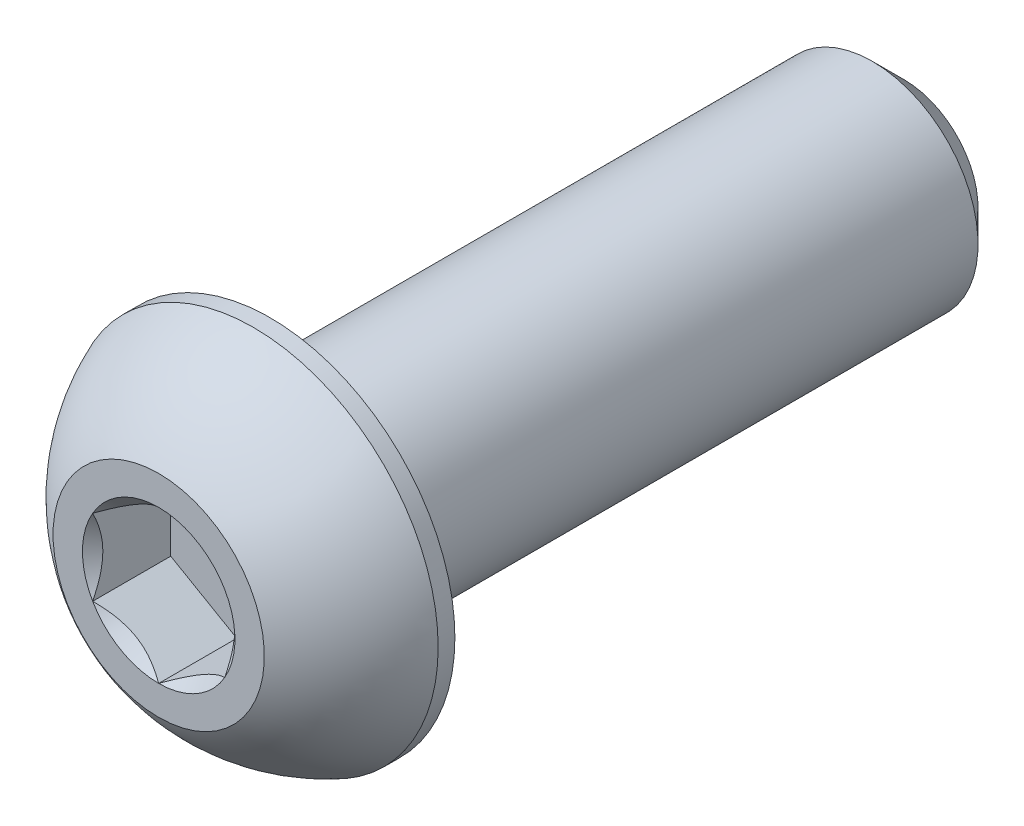
ISO-10303-21;
HEADER;
FILE_DESCRIPTION(('STEP AP214'),'2;1');
FILE_NAME('part.step','',(''),(''),'','','');
FILE_SCHEMA(('AUTOMOTIVE_DESIGN { 1 0 10303 214 1 1 1 1 }'));
ENDSEC;
DATA;
#1=APPLICATION_CONTEXT('core data for automotive mechanical design processes');
#2=APPLICATION_PROTOCOL_DEFINITION('international standard','automotive_design',2000,#1);
#3=PRODUCT_CONTEXT('',#1,'mechanical');
#4=PRODUCT('Part','Part','',(#3));
#5=PRODUCT_RELATED_PRODUCT_CATEGORY('part','',(#4));
#6=PRODUCT_DEFINITION_FORMATION('','',#4);
#7=PRODUCT_DEFINITION_CONTEXT('part definition',#1,'design');
#8=PRODUCT_DEFINITION('design','',#6,#7);
#9=PRODUCT_DEFINITION_SHAPE('','',#8);
#10=(LENGTH_UNIT() NAMED_UNIT(*) SI_UNIT(.MILLI.,.METRE.));
#11=(NAMED_UNIT(*) PLANE_ANGLE_UNIT() SI_UNIT($,.RADIAN.));
#12=(NAMED_UNIT(*) SI_UNIT($,.STERADIAN.) SOLID_ANGLE_UNIT());
#13=UNCERTAINTY_MEASURE_WITH_UNIT(LENGTH_MEASURE(1.E-05),#10,'distance_accuracy_value','');
#14=(GEOMETRIC_REPRESENTATION_CONTEXT(3) GLOBAL_UNCERTAINTY_ASSIGNED_CONTEXT((#13)) GLOBAL_UNIT_ASSIGNED_CONTEXT((#10,
#11,#12)) REPRESENTATION_CONTEXT('',''));
#15=CARTESIAN_POINT('',(0.,0.,0.));
#16=DIRECTION('',(0.,0.,1.));
#17=DIRECTION('',(1.,0.,0.));
#18=AXIS2_PLACEMENT_3D('',#15,#16,#17);
#19=CARTESIAN_POINT('',(0.,-3.17500000000001,-22.4028));
#20=DIRECTION('',(0.,0.,-1.));
#21=DIRECTION('',(0.,1.,0.));
#22=AXIS2_PLACEMENT_3D('',#19,#20,#21);
#23=PLANE('',#22);
#24=CARTESIAN_POINT('',(0.,0.,-22.4028));
#25=DIRECTION('',(0.,0.,-1.));
#26=DIRECTION('',(0.,1.,0.));
#27=AXIS2_PLACEMENT_3D('',#24,#25,#26);
#28=CIRCLE('',#27,2.2225);
#29=CARTESIAN_POINT('',(0.,2.2225,-22.4028));
#30=VERTEX_POINT('',#29);
#31=EDGE_CURVE('E177',#30,#30,#28,.T.);
#32=ORIENTED_EDGE('',*,*,#31,.T.);
#33=EDGE_LOOP('',(#32));
#34=FACE_BOUND('',#33,.T.);
#35=ADVANCED_FACE('F37',(#34),#23,.T.);
#36=CARTESIAN_POINT('',(0.,0.,-22.4028));
#37=DIRECTION('',(0.,0.,-1.));
#38=DIRECTION('',(0.,1.,0.));
#39=AXIS2_PLACEMENT_3D('',#36,#37,#38);
#40=CYLINDRICAL_SURFACE('',#39,3.175);
#41=CARTESIAN_POINT('',(0.,0.,-21.4503));
#42=DIRECTION('',(0.,0.,-1.));
#43=DIRECTION('',(0.,1.,0.));
#44=AXIS2_PLACEMENT_3D('',#41,#42,#43);
#45=CIRCLE('',#44,3.175);
#46=CARTESIAN_POINT('',(0.,3.175,-21.4503));
#47=VERTEX_POINT('',#46);
#48=EDGE_CURVE('E51',#47,#47,#45,.F.);
#49=ORIENTED_EDGE('',*,*,#48,.T.);
#50=EDGE_LOOP('',(#49));
#51=FACE_BOUND('',#50,.T.);
#52=CARTESIAN_POINT('',(0.,0.,-3.3528));
#53=DIRECTION('',(0.,0.,1.));
#54=DIRECTION('',(1.,0.,0.));
#55=AXIS2_PLACEMENT_3D('',#52,#53,#54);
#56=CIRCLE('',#55,3.175);
#57=CARTESIAN_POINT('',(3.175,0.,-3.3528));
#58=VERTEX_POINT('',#57);
#59=EDGE_CURVE('E174',#58,#58,#56,.F.);
#60=ORIENTED_EDGE('',*,*,#59,.T.);
#61=EDGE_LOOP('',(#60));
#62=FACE_BOUND('',#61,.T.);
#63=ADVANCED_FACE('F182',(#51,#62),#40,.T.);
#64=CARTESIAN_POINT('',(0.,0.,-22.4028));
#65=DIRECTION('',(0.,0.,1.));
#66=DIRECTION('',(0.,-1.,0.));
#67=AXIS2_PLACEMENT_3D('',#64,#65,#66);
#68=CONICAL_SURFACE('',#67,2.2225,0.785398163397447);
#69=ORIENTED_EDGE('',*,*,#48,.F.);
#70=EDGE_LOOP('',(#69));
#71=FACE_BOUND('',#70,.T.);
#72=ORIENTED_EDGE('',*,*,#31,.F.);
#73=EDGE_LOOP('',(#72));
#74=FACE_BOUND('',#73,.T.);
#75=ADVANCED_FACE('F39',(#71,#74),#68,.T.);
#76=CARTESIAN_POINT('',(0.,0.,-5.060315));
#77=DIRECTION('',(0.,0.,1.));
#78=DIRECTION('',(0.,-1.,0.));
#79=AXIS2_PLACEMENT_3D('',#76,#77,#78);
#80=SPHERICAL_SURFACE('',#79,5.97389428256184);
#81=CARTESIAN_POINT('',(0.,0.,0.));
#82=DIRECTION('',(0.,0.,1.));
#83=DIRECTION('',(1.,0.,0.));
#84=AXIS2_PLACEMENT_3D('',#81,#82,#83);
#85=CIRCLE('',#84,3.175);
#86=CARTESIAN_POINT('',(0.,-3.175,0.));
#87=VERTEX_POINT('',#86);
#88=EDGE_CURVE('E171',#87,#87,#85,.T.);
#89=CARTESIAN_POINT('',(0.,0.,-2.84988));
#90=DIRECTION('',(0.,0.,1.));
#91=DIRECTION('',(1.,0.,0.));
#92=AXIS2_PLACEMENT_3D('',#89,#90,#91);
#93=CIRCLE('',#92,5.5499);
#94=CARTESIAN_POINT('',(0.,-5.5499,-2.84988));
#95=VERTEX_POINT('',#94);
#96=EDGE_CURVE('E165',#95,#95,#93,.T.);
#97=CARTESIAN_POINT('',(0.,-3.175,0.));
#98=CARTESIAN_POINT('',(0.,-3.20828343957184,-0.0208830076580502));
#99=CARTESIAN_POINT('',(0.,-3.24136078860705,-0.0420944789280503));
#100=CARTESIAN_POINT('',(0.,-3.30709055775141,-0.0851658910984718));
#101=CARTESIAN_POINT('',(0.,-3.33974297786056,-0.107025831998893));
#102=CARTESIAN_POINT('',(0.,-3.40461014130008,-0.151385725836676));
#103=CARTESIAN_POINT('',(0.,-3.43682488463043,-0.173885678774039));
#104=CARTESIAN_POINT('',(0.,-3.50080416139461,-0.219516822259479));
#105=CARTESIAN_POINT('',(0.,-3.53256869482844,-0.242648012807557));
#106=CARTESIAN_POINT('',(0.,-3.59563518208834,-0.289532629449102));
#107=CARTESIAN_POINT('',(0.,-3.62693713591442,-0.313286055542569));
#108=CARTESIAN_POINT('',(0.,-3.68906627753106,-0.36140589409133));
#109=CARTESIAN_POINT('',(0.,-3.71989346532163,-0.385772306546626));
#110=CARTESIAN_POINT('',(0.,-3.78106107243204,-0.435108631276877));
#111=CARTESIAN_POINT('',(0.,-3.8114014917519,-0.460078543551833));
#112=CARTESIAN_POINT('',(0.,-3.87158374923259,-0.510612146063938));
#113=CARTESIAN_POINT('',(0.,-3.90142558739343,-0.536175836301086));
#114=CARTESIAN_POINT('',(0.,-3.96059906392414,-0.587887041792083));
#115=CARTESIAN_POINT('',(0.,-3.989930702294,-0.614034557045931));
#116=CARTESIAN_POINT('',(0.,-4.04807235926832,-0.666903232293407));
#117=CARTESIAN_POINT('',(0.,-4.07688237787279,-0.693624392287034));
#118=CARTESIAN_POINT('',(0.,-4.13396957842491,-0.747629953401057));
#119=CARTESIAN_POINT('',(0.,-4.16224676037257,-0.774914354521453));
#120=CARTESIAN_POINT('',(0.,-4.21825727817542,-0.830035774981947));
#121=CARTESIAN_POINT('',(0.,-4.24599061403061,-0.857872794322045));
#122=CARTESIAN_POINT('',(0.,-4.30090264195357,-0.91408861315902));
#123=CARTESIAN_POINT('',(0.,-4.32808133402134,-0.942467412655899));
#124=CARTESIAN_POINT('',(0.,-4.38187349261953,-0.999755742806741));
#125=CARTESIAN_POINT('',(0.,-4.40848695914995,-1.0286652734607));
#126=CARTESIAN_POINT('',(0.,-4.46113830498838,-1.08700381029123));
#127=CARTESIAN_POINT('',(0.,-4.48717618429639,-1.11643281646778));
#128=CARTESIAN_POINT('',(0.,-4.53866621810402,-1.17579884645643));
#129=CARTESIAN_POINT('',(0.,-4.56411837260364,-1.20573587026853));
#130=CARTESIAN_POINT('',(0.,-4.61442704725457,-1.26610627984964));
#131=CARTESIAN_POINT('',(0.,-4.63928356740587,-1.29653966561866));
#132=CARTESIAN_POINT('',(0.,-4.68839129572448,-1.3578909501815));
#133=CARTESIAN_POINT('',(0.,-4.71264250389178,-1.38880884897531));
#134=CARTESIAN_POINT('',(0.,-4.76053016627881,-1.45111712201534));
#135=CARTESIAN_POINT('',(0.,-4.78416662049853,-1.48250749626155));
#136=CARTESIAN_POINT('',(0.,-4.8308155723751,-1.54574849868041));
#137=CARTESIAN_POINT('',(0.,-4.85382807003194,-1.57759912685306));
#138=CARTESIAN_POINT('',(0.,-4.89922014909859,-1.64174823640362));
#139=CARTESIAN_POINT('',(0.,-4.92159973050841,-1.67404671778154));
#140=CARTESIAN_POINT('',(0.,-4.96571726381658,-1.73907895865427));
#141=CARTESIAN_POINT('',(0.,-4.98745521571493,-1.77181271814908));
#142=CARTESIAN_POINT('',(0.,-5.03028102654719,-1.83770277069632));
#143=CARTESIAN_POINT('',(0.,-5.0513688854811,-1.87085906374874));
#144=CARTESIAN_POINT('',(0.,-5.09288630004063,-1.93758127434189));
#145=CARTESIAN_POINT('',(0.,-5.11331585566624,-1.97114719188261));
#146=CARTESIAN_POINT('',(0.,-5.15350870956168,-2.03867558290299));
#147=CARTESIAN_POINT('',(0.,-5.17327200783151,-2.07263805638265));
#148=CARTESIAN_POINT('',(0.,-5.21212465239608,-2.14094633632486));
#149=CARTESIAN_POINT('',(0.,-5.23121399869082,-2.17529214278741));
#150=CARTESIAN_POINT('',(0.,-5.26871130697935,-2.2443537165359));
#151=CARTESIAN_POINT('',(0.,-5.28711926897315,-2.27906948382184));
#152=CARTESIAN_POINT('',(0.,-5.32324664200827,-2.3488574628552));
#153=CARTESIAN_POINT('',(0.,-5.3409660530496,-2.38392967460262));
#154=CARTESIAN_POINT('',(0.,-5.37570942417474,-2.45441688802313));
#155=CARTESIAN_POINT('',(0.,-5.39273338425856,-2.48983188969622));
#156=CARTESIAN_POINT('',(0.,-5.42607922958184,-2.56099089271574));
#157=CARTESIAN_POINT('',(0.,-5.44240111482132,-2.59673489406217));
#158=CARTESIAN_POINT('',(0.,-5.47433643994316,-2.66853798649801));
#159=CARTESIAN_POINT('',(0.,-5.48994987982553,-2.70459707758742));
#160=CARTESIAN_POINT('',(0.,-5.52046229408188,-2.77701628549785));
#161=CARTESIAN_POINT('',(0.,-5.53536126845586,-2.81337640231887));
#162=CARTESIAN_POINT('',(0.,-5.5499,-2.84988));
#163=B_SPLINE_CURVE_WITH_KNOTS('',3,(#97,#98,#99,#100,#101,#102,#103,#104,#105,#106,#107,#108,
#109,#110,#111,#112,#113,#114,#115,#116,#117,#118,#119,#120,#121,#122,#123,#124,#125,#126,#127,
#128,#129,#130,#131,#132,#133,#134,#135,#136,#137,#138,#139,#140,#141,#142,#143,#144,#145,#146,
#147,#148,#149,#150,#151,#152,#153,#154,#155,#156,#157,#158,#159,#160,#161,#162),.UNSPECIFIED.,
.F.,.F.,(4,2,2,2,2,2,2,2,2,2,2,2,2,2,2,2,2,2,2,2,2,2,2,2,2,2,2,2,2,2,2,2,4),(0.,0.1178750807537,
0.235750161507399,0.353625242261099,0.471500323014798,0.589375403768498,0.707250484522198,
0.825125565275897,0.943000646029597,1.0608757267833,1.17875080753699,1.2966258882907,
1.41450096904439,1.53237604979809,1.65025113055179,1.76812621130549,1.88600129205919,
2.00387637281289,2.12175145356659,2.23962653432029,2.35750161507399,2.47537669582769,
2.59325177658139,2.71112685733509,2.82900193808879,2.94687701884249,3.06475209959619,
3.18262718034989,3.30050226110359,3.41837734185729,3.53625242261099,3.65412750336469,
3.77200258411839),.UNSPECIFIED.);
#164=EDGE_CURVE('BSEAM187',#87,#95,#163,.T.);
#165=ORIENTED_EDGE('',*,*,#88,.F.);
#166=ORIENTED_EDGE('',*,*,#96,.T.);
#167=ORIENTED_EDGE('',*,*,#164,.T.);
#168=ORIENTED_EDGE('',*,*,#164,.F.);
#169=EDGE_LOOP('',(#165,#167,#166,#168));
#170=FACE_BOUND('',#169,.T.);
#171=ADVANCED_FACE('F187',(#170),#80,.T.);
#172=CARTESIAN_POINT('',(0.,-3.175,0.));
#173=DIRECTION('',(0.,0.,-1.));
#174=DIRECTION('',(-1.,0.,0.));
#175=AXIS2_PLACEMENT_3D('',#172,#173,#174);
#176=PLANE('',#175);
#177=CARTESIAN_POINT('',(0.,0.,0.));
#178=DIRECTION('',(0.,0.,1.));
#179=DIRECTION('',(1.,0.,0.));
#180=AXIS2_PLACEMENT_3D('',#177,#178,#179);
#181=CIRCLE('',#180,2.29135888084633);
#182=CARTESIAN_POINT('',(-1.984375,1.14567944042316,0.));
#183=VERTEX_POINT('',#182);
#184=CARTESIAN_POINT('',(-1.984375,-1.14567944042316,0.));
#185=VERTEX_POINT('',#184);
#186=EDGE_CURVE('E64',#183,#185,#181,.T.);
#187=ORIENTED_EDGE('',*,*,#186,.F.);
#188=CARTESIAN_POINT('',(0.,2.29135888084633,0.));
#189=VERTEX_POINT('',#188);
#190=EDGE_CURVE('E136',#189,#183,#181,.T.);
#191=ORIENTED_EDGE('',*,*,#190,.F.);
#192=CARTESIAN_POINT('',(1.984375,1.14567944042316,0.));
#193=VERTEX_POINT('',#192);
#194=EDGE_CURVE('E133',#193,#189,#181,.T.);
#195=ORIENTED_EDGE('',*,*,#194,.F.);
#196=CARTESIAN_POINT('',(1.984375,-1.14567944042316,0.));
#197=VERTEX_POINT('',#196);
#198=EDGE_CURVE('E104',#197,#193,#181,.T.);
#199=ORIENTED_EDGE('',*,*,#198,.F.);
#200=CARTESIAN_POINT('',(0.,-2.29135888084633,0.));
#201=VERTEX_POINT('',#200);
#202=EDGE_CURVE('E96',#201,#197,#181,.T.);
#203=ORIENTED_EDGE('',*,*,#202,.F.);
#204=EDGE_CURVE('E57',#185,#201,#181,.T.);
#205=ORIENTED_EDGE('',*,*,#204,.F.);
#206=EDGE_LOOP('',(#187,#191,#195,#199,#203,#205));
#207=FACE_BOUND('',#206,.T.);
#208=ORIENTED_EDGE('',*,*,#88,.T.);
#209=EDGE_LOOP('',(#208));
#210=FACE_BOUND('',#209,.T.);
#211=ADVANCED_FACE('F130',(#207,#210),#176,.F.);
#212=CARTESIAN_POINT('',(0.,-5.5499,-3.3528));
#213=DIRECTION('',(0.,0.,1.));
#214=DIRECTION('',(1.,0.,0.));
#215=AXIS2_PLACEMENT_3D('',#212,#213,#214);
#216=PLANE('',#215);
#217=ORIENTED_EDGE('',*,*,#59,.F.);
#218=EDGE_LOOP('',(#217));
#219=FACE_BOUND('',#218,.T.);
#220=CARTESIAN_POINT('',(0.,0.,-3.3528));
#221=DIRECTION('',(0.,0.,1.));
#222=DIRECTION('',(1.,0.,0.));
#223=AXIS2_PLACEMENT_3D('',#220,#221,#222);
#224=CIRCLE('',#223,5.5499);
#225=CARTESIAN_POINT('',(5.5499,0.,-3.3528));
#226=VERTEX_POINT('',#225);
#227=EDGE_CURVE('E168',#226,#226,#224,.T.);
#228=ORIENTED_EDGE('',*,*,#227,.F.);
#229=EDGE_LOOP('',(#228));
#230=FACE_BOUND('',#229,.T.);
#231=ADVANCED_FACE('F201',(#219,#230),#216,.F.);
#232=CARTESIAN_POINT('',(0.,0.,0.));
#233=DIRECTION('',(0.,0.,1.));
#234=DIRECTION('',(1.,0.,0.));
#235=AXIS2_PLACEMENT_3D('',#232,#233,#234);
#236=CYLINDRICAL_SURFACE('',#235,5.5499);
#237=ORIENTED_EDGE('',*,*,#96,.F.);
#238=EDGE_LOOP('',(#237));
#239=FACE_BOUND('',#238,.T.);
#240=ORIENTED_EDGE('',*,*,#227,.T.);
#241=EDGE_LOOP('',(#240));
#242=FACE_BOUND('',#241,.T.);
#243=ADVANCED_FACE('F204',(#239,#242),#236,.T.);
#244=CARTESIAN_POINT('',(0.,0.,0.));
#245=DIRECTION('',(0.,0.,1.));
#246=DIRECTION('',(1.,0.,0.));
#247=AXIS2_PLACEMENT_3D('',#244,#245,#246);
#248=CONICAL_SURFACE('',#247,2.29135888084633,0.78539816339745);
#249=ORIENTED_EDGE('',*,*,#198,.T.);
#250=CARTESIAN_POINT('',(1.984375,-2.28495242157822,0.734984078816568));
#251=CARTESIAN_POINT('',(1.984375,-2.22931635455402,0.692986685550762));
#252=CARTESIAN_POINT('',(1.984375,-2.17336876548389,0.651396054076336));
#253=CARTESIAN_POINT('',(1.984375,-2.06072770258171,0.569208461471479));
#254=CARTESIAN_POINT('',(1.984375,-2.00403404503435,0.528611752405042));
#255=CARTESIAN_POINT('',(1.984375,-1.88936329173488,0.448303503174668));
#256=CARTESIAN_POINT('',(1.984375,-1.83137965519348,0.408601258813307));
#257=CARTESIAN_POINT('',(1.984375,-1.7144280213784,0.330685173401292));
#258=CARTESIAN_POINT('',(1.984375,-1.65546009407228,0.292471227194368));
#259=CARTESIAN_POINT('',(1.984375,-1.47005472306035,0.176252834013637));
#260=CARTESIAN_POINT('',(1.984375,-1.34163909427883,0.101347886872381));
#261=CARTESIAN_POINT('',(1.984375,-1.0784038470548,-0.0356697845602627));
#262=CARTESIAN_POINT('',(1.984375,-0.943607781407424,-0.0978256335176254));
#263=CARTESIAN_POINT('',(1.984375,-0.741275100444881,-0.173867421311381));
#264=CARTESIAN_POINT('',(1.984375,-0.676735408881095,-0.195691938673995));
#265=CARTESIAN_POINT('',(1.984375,-0.546098118112761,-0.234159536462205));
#266=CARTESIAN_POINT('',(1.984375,-0.480000411919955,-0.250802259934452));
#267=CARTESIAN_POINT('',(1.984375,-0.347746170028531,-0.277764619130277));
#268=CARTESIAN_POINT('',(1.984375,-0.281612071479122,-0.288192590264109));
#269=CARTESIAN_POINT('',(1.984375,-0.14863662005235,-0.302521852623404));
#270=CARTESIAN_POINT('',(1.984375,-0.0817953907393235,-0.306424265772614));
#271=CARTESIAN_POINT('',(1.984375,0.0495156750890644,-0.307412948667327));
#272=CARTESIAN_POINT('',(1.984375,0.113983775102991,-0.304740821124985));
#273=CARTESIAN_POINT('',(1.984375,0.242367515846177,-0.293260789502485));
#274=CARTESIAN_POINT('',(1.984375,0.30628310229592,-0.284452289360786));
#275=CARTESIAN_POINT('',(1.984375,0.434181040262184,-0.261030978667103));
#276=CARTESIAN_POINT('',(1.984375,0.498145026858309,-0.246319393767914));
#277=CARTESIAN_POINT('',(1.984375,0.624675616953007,-0.211873818587874));
#278=CARTESIAN_POINT('',(1.984375,0.687242336899689,-0.192140248550805));
#279=CARTESIAN_POINT('',(1.984375,0.884225483826088,-0.12258776276924));
#280=CARTESIAN_POINT('',(1.984375,1.01583674256468,-0.0648475887435034));
#281=CARTESIAN_POINT('',(1.984375,1.27288659242652,0.063530336588798));
#282=CARTESIAN_POINT('',(1.984375,1.3983008827048,0.134214424919413));
#283=CARTESIAN_POINT('',(1.984375,1.57956687990221,0.244516663813199));
#284=CARTESIAN_POINT('',(1.984375,1.63738271299424,0.280969829475364));
#285=CARTESIAN_POINT('',(1.984375,1.75202215386202,0.355415963291705));
#286=CARTESIAN_POINT('',(1.984375,1.80884568601362,0.393409048078054));
#287=CARTESIAN_POINT('',(1.984375,1.92116923084255,0.470338808893091));
#288=CARTESIAN_POINT('',(1.984375,1.97667624512253,0.509265313038791));
#289=CARTESIAN_POINT('',(1.984375,2.08693170717166,0.588147746121386));
#290=CARTESIAN_POINT('',(1.984375,2.14168035934793,0.62810338902403));
#291=CARTESIAN_POINT('',(1.984375,2.19611149046622,0.668480611285427));
#292=B_SPLINE_CURVE_WITH_KNOTS('',3,(#250,#251,#252,#253,#254,#255,#256,#257,#258,#259,#260,
#261,#262,#263,#264,#265,#266,#267,#268,#269,#270,#271,#272,#273,#274,#275,#276,#277,#278,#279,
#280,#281,#282,#283,#284,#285,#286,#287,#288,#289,#290,#291),.UNSPECIFIED.,.F.,.F.,(4,2,2,2,2,2,
2,2,2,2,2,2,2,2,2,2,2,2,2,2,4),(0.,0.209126070008322,0.418304637356569,0.629103979977992,
0.839888401371185,1.28549951116127,1.72957750768351,1.93379389749971,2.13802435186698,
2.33858179514334,2.53910475350639,2.73236963400794,2.92565329006887,3.12231577097487,
3.31896180041345,3.74886295245172,4.18033428125362,4.3853601718029,4.59040161996383,
4.79377749165108,4.99709743524131),.UNSPECIFIED.);
#293=EDGE_CURVE('E11',#197,#193,#292,.T.);
#294=ORIENTED_EDGE('',*,*,#293,.F.);
#295=EDGE_LOOP('',(#249,#294));
#296=FACE_BOUND('',#295,.T.);
#297=ADVANCED_FACE('F108',(#296),#248,.F.);
#298=ORIENTED_EDGE('',*,*,#194,.T.);
#299=CARTESIAN_POINT('',(1.984575,1.14556397036933,0.000115478781843379));
#300=CARTESIAN_POINT('',(1.9163590048332,1.18494849354192,-0.0392371477360855));
#301=CARTESIAN_POINT('',(1.84700231489303,1.22499159714897,-0.0762786895538155));
#302=CARTESIAN_POINT('',(1.70557619954781,1.30664400291398,-0.144101141576677));
#303=CARTESIAN_POINT('',(1.63349332126322,1.34826107209555,-0.174844310908246));
#304=CARTESIAN_POINT('',(1.488141602734,1.43217992591557,-0.227508111188786));
#305=CARTESIAN_POINT('',(1.41490978751306,1.47446033414663,-0.249561124120036));
#306=CARTESIAN_POINT('',(1.26683381740529,1.55995203534886,-0.283538507056124));
#307=CARTESIAN_POINT('',(1.19199418724658,1.60316071596705,-0.295488243908271));
#308=CARTESIAN_POINT('',(1.06301458545618,1.6776271237807,-0.306269900918094));
#309=CARTESIAN_POINT('',(1.00904128422756,1.7087886237741,-0.30786610094093));
#310=CARTESIAN_POINT('',(0.901182881480199,1.77106070163465,-0.305178161134708));
#311=CARTESIAN_POINT('',(0.847297817514476,1.80217125782056,-0.300891959659541));
#312=CARTESIAN_POINT('',(0.740036461751395,1.86409863044402,-0.286683126986481));
#313=CARTESIAN_POINT('',(0.686660807239859,1.89491507894443,-0.276754189547727));
#314=CARTESIAN_POINT('',(0.580832482591103,1.95601509066828,-0.251804915725461));
#315=CARTESIAN_POINT('',(0.528379742028898,1.9862986945516,-0.236784969610512));
#316=CARTESIAN_POINT('',(0.394017661036351,2.06387267818152,-0.19219214836433));
#317=CARTESIAN_POINT('',(0.312941642841675,2.11068193911104,-0.159257004061667));
#318=CARTESIAN_POINT('',(0.19372669327016,2.17951072233758,-0.103657558797803));
#319=CARTESIAN_POINT('',(0.154440075613998,2.20219286161692,-0.0841224079481375));
#320=CARTESIAN_POINT('',(0.0765946381319467,2.24713694590237,-0.0432712618805984));
#321=CARTESIAN_POINT('',(0.0380353888983008,2.26939913882716,-0.0219563604316496));
#322=CARTESIAN_POINT('',(-0.00020000000000058,2.29147435090017,0.000115478781842942));
#323=B_SPLINE_CURVE_WITH_KNOTS('',3,(#299,#300,#301,#302,#303,#304,#305,#306,#307,#308,#309,
#310,#311,#312,#313,#314,#315,#316,#317,#318,#319,#320,#321,#322),.UNSPECIFIED.,.F.,.F.,(4,2,2,
2,2,2,2,2,2,2,2,4),(0.,0.264339630306627,0.530219665093694,0.79187641637146,1.05287424418109,
1.239639843932,1.42647091743852,1.61351120244035,1.8005371524754,2.09764209964316,
2.24579179873714,2.39385111134157),.UNSPECIFIED.);
#324=EDGE_CURVE('E135',#193,#189,#323,.T.);
#325=ORIENTED_EDGE('',*,*,#324,.F.);
#326=EDGE_LOOP('',(#298,#325));
#327=FACE_BOUND('',#326,.T.);
#328=ADVANCED_FACE('F289',(#327),#248,.F.);
#329=ORIENTED_EDGE('',*,*,#190,.T.);
#330=CARTESIAN_POINT('',(0.000199999999999608,2.29147435090017,0.000115478781843248));
#331=CARTESIAN_POINT('',(-0.0680159951668025,2.25208982772757,-0.0392371477360854));
#332=CARTESIAN_POINT('',(-0.137372685106966,2.21204672412052,-0.0762786895538155));
#333=CARTESIAN_POINT('',(-0.278798800452188,2.13039431835551,-0.144101141576677));
#334=CARTESIAN_POINT('',(-0.350881678736783,2.08877724917394,-0.174844310908246));
#335=CARTESIAN_POINT('',(-0.496233397266004,2.00485839535392,-0.227508111188786));
#336=CARTESIAN_POINT('',(-0.569465212486939,1.96257798712287,-0.249561124120036));
#337=CARTESIAN_POINT('',(-0.717541182594707,1.87708628592063,-0.283538507056124));
#338=CARTESIAN_POINT('',(-0.792380812753425,1.83387760530244,-0.295488243908272));
#339=CARTESIAN_POINT('',(-0.921360414543816,1.75941119748879,-0.306269900918094));
#340=CARTESIAN_POINT('',(-0.975333715772443,1.72824969749539,-0.307866100940931));
#341=CARTESIAN_POINT('',(-1.0831921185198,1.66597761963484,-0.305178161134708));
#342=CARTESIAN_POINT('',(-1.13707718248552,1.63486706344893,-0.300891959659541));
#343=CARTESIAN_POINT('',(-1.2443385382486,1.57293969082547,-0.286683126986481));
#344=CARTESIAN_POINT('',(-1.29771419276014,1.54212324232506,-0.276754189547727));
#345=CARTESIAN_POINT('',(-1.4035425174089,1.48102323060122,-0.251804915725462));
#346=CARTESIAN_POINT('',(-1.4559952579711,1.45073962671789,-0.236784969610512));
#347=CARTESIAN_POINT('',(-1.59035733896365,1.37316564308797,-0.19219214836433));
#348=CARTESIAN_POINT('',(-1.67143335715832,1.32635638215845,-0.159257004061668));
#349=CARTESIAN_POINT('',(-1.79064830672984,1.25752759893191,-0.103657558797804));
#350=CARTESIAN_POINT('',(-1.829934924386,1.23484545965257,-0.0841224079481378));
#351=CARTESIAN_POINT('',(-1.90778036186805,1.18990137536712,-0.0432712618805986));
#352=CARTESIAN_POINT('',(-1.9463396111017,1.16763918244233,-0.0219563604316498));
#353=CARTESIAN_POINT('',(-1.984575,1.14556397036933,0.000115478781842511));
#354=B_SPLINE_CURVE_WITH_KNOTS('',3,(#330,#331,#332,#333,#334,#335,#336,#337,#338,#339,#340,
#341,#342,#343,#344,#345,#346,#347,#348,#349,#350,#351,#352,#353),.UNSPECIFIED.,.F.,.F.,(4,2,2,
2,2,2,2,2,2,2,2,4),(0.,0.264339630306627,0.530219665093694,0.791876416371461,1.05287424418109,
1.239639843932,1.42647091743852,1.61351120244035,1.8005371524754,2.09764209964316,
2.24579179873714,2.39385111134157),.UNSPECIFIED.);
#355=EDGE_CURVE('E140',#189,#183,#354,.T.);
#356=ORIENTED_EDGE('',*,*,#355,.F.);
#357=EDGE_LOOP('',(#329,#356));
#358=FACE_BOUND('',#357,.T.);
#359=ADVANCED_FACE('F143',(#358),#248,.F.);
#360=ORIENTED_EDGE('',*,*,#186,.T.);
#361=CARTESIAN_POINT('',(-1.984375,-2.28495242157823,0.734984078816569));
#362=CARTESIAN_POINT('',(-1.984375,-2.22931635455402,0.692986685550762));
#363=CARTESIAN_POINT('',(-1.984375,-2.17336876548389,0.651396054076336));
#364=CARTESIAN_POINT('',(-1.984375,-2.06072770258171,0.56920846147148));
#365=CARTESIAN_POINT('',(-1.984375,-2.00403404503435,0.528611752405043));
#366=CARTESIAN_POINT('',(-1.984375,-1.88936329173489,0.448303503174669));
#367=CARTESIAN_POINT('',(-1.984375,-1.83137965519348,0.408601258813308));
#368=CARTESIAN_POINT('',(-1.984375,-1.7144280213784,0.330685173401292));
#369=CARTESIAN_POINT('',(-1.984375,-1.65546009407228,0.292471227194368));
#370=CARTESIAN_POINT('',(-1.984375,-1.47005472306035,0.176252834013636));
#371=CARTESIAN_POINT('',(-1.984375,-1.34163909427883,0.101347886872382));
#372=CARTESIAN_POINT('',(-1.984375,-1.0784038470548,-0.0356697845602624));
#373=CARTESIAN_POINT('',(-1.984375,-0.943607781407425,-0.0978256335176256));
#374=CARTESIAN_POINT('',(-1.984375,-0.741275100444882,-0.173867421311381));
#375=CARTESIAN_POINT('',(-1.984375,-0.676735408881095,-0.195691938673995));
#376=CARTESIAN_POINT('',(-1.984375,-0.546098118112762,-0.234159536462205));
#377=CARTESIAN_POINT('',(-1.984375,-0.480000411919956,-0.250802259934452));
#378=CARTESIAN_POINT('',(-1.984375,-0.347746170028532,-0.277764619130277));
#379=CARTESIAN_POINT('',(-1.984375,-0.281612071479123,-0.288192590264108));
#380=CARTESIAN_POINT('',(-1.984375,-0.14863662005235,-0.302521852623404));
#381=CARTESIAN_POINT('',(-1.984375,-0.0817953907393237,-0.306424265772614));
#382=CARTESIAN_POINT('',(-1.984375,0.0495156750890643,-0.307412948667328));
#383=CARTESIAN_POINT('',(-1.984375,0.113983775102991,-0.304740821124985));
#384=CARTESIAN_POINT('',(-1.984375,0.242367515846177,-0.293260789502485));
#385=CARTESIAN_POINT('',(-1.984375,0.306283102295919,-0.284452289360786));
#386=CARTESIAN_POINT('',(-1.984375,0.434181040262184,-0.261030978667103));
#387=CARTESIAN_POINT('',(-1.984375,0.498145026858309,-0.246319393767914));
#388=CARTESIAN_POINT('',(-1.984375,0.624675616953007,-0.211873818587874));
#389=CARTESIAN_POINT('',(-1.984375,0.687242336899689,-0.192140248550805));
#390=CARTESIAN_POINT('',(-1.984375,0.884225483826087,-0.12258776276924));
#391=CARTESIAN_POINT('',(-1.984375,1.01583674256468,-0.0648475887435036));
#392=CARTESIAN_POINT('',(-1.984375,1.27288659242652,0.0635303365887976));
#393=CARTESIAN_POINT('',(-1.984375,1.3983008827048,0.134214424919412));
#394=CARTESIAN_POINT('',(-1.984375,1.57956687990221,0.244516663813198));
#395=CARTESIAN_POINT('',(-1.984375,1.63738271299424,0.280969829475363));
#396=CARTESIAN_POINT('',(-1.984375,1.75202215386202,0.355415963291704));
#397=CARTESIAN_POINT('',(-1.984375,1.80884568601362,0.393409048078054));
#398=CARTESIAN_POINT('',(-1.984375,1.92116923084255,0.47033880889309));
#399=CARTESIAN_POINT('',(-1.984375,1.97667624512253,0.509265313038791));
#400=CARTESIAN_POINT('',(-1.984375,2.08693170717166,0.588147746121386));
#401=CARTESIAN_POINT('',(-1.984375,2.14168035934793,0.628103389024029));
#402=CARTESIAN_POINT('',(-1.984375,2.19611149046622,0.668480611285426));
#403=B_SPLINE_CURVE_WITH_KNOTS('',3,(#361,#362,#363,#364,#365,#366,#367,#368,#369,#370,#371,
#372,#373,#374,#375,#376,#377,#378,#379,#380,#381,#382,#383,#384,#385,#386,#387,#388,#389,#390,
#391,#392,#393,#394,#395,#396,#397,#398,#399,#400,#401,#402),.UNSPECIFIED.,.F.,.F.,(4,2,2,2,2,2,
2,2,2,2,2,2,2,2,2,2,2,2,2,2,4),(0.,0.209126070008322,0.41830463735657,0.629103979977993,
0.839888401371186,1.28549951116127,1.72957750768351,1.93379389749972,2.13802435186698,
2.33858179514334,2.53910475350639,2.73236963400794,2.92565329006887,3.12231577097488,
3.31896180041345,3.74886295245172,4.18033428125362,4.3853601718029,4.59040161996383,
4.79377749165108,4.99709743524131),.UNSPECIFIED.);
#404=EDGE_CURVE('E147',#183,#185,#403,.F.);
#405=ORIENTED_EDGE('',*,*,#404,.F.);
#406=EDGE_LOOP('',(#360,#405));
#407=FACE_BOUND('',#406,.T.);
#408=ADVANCED_FACE('F283',(#407),#248,.F.);
#409=ORIENTED_EDGE('',*,*,#204,.T.);
#410=CARTESIAN_POINT('',(-1.984575,-1.14556397036933,0.000115478781843379));
#411=CARTESIAN_POINT('',(-1.9163590048332,-1.18494849354192,-0.0392371477360847));
#412=CARTESIAN_POINT('',(-1.84700231489303,-1.22499159714897,-0.0762786895538149));
#413=CARTESIAN_POINT('',(-1.70557619954781,-1.30664400291398,-0.144101141576677));
#414=CARTESIAN_POINT('',(-1.63349332126322,-1.34826107209555,-0.174844310908247));
#415=CARTESIAN_POINT('',(-1.488141602734,-1.43217992591557,-0.227508111188786));
#416=CARTESIAN_POINT('',(-1.41490978751306,-1.47446033414663,-0.249561124120036));
#417=CARTESIAN_POINT('',(-1.26683381740529,-1.55995203534886,-0.283538507056124));
#418=CARTESIAN_POINT('',(-1.19199418724658,-1.60316071596705,-0.295488243908271));
#419=CARTESIAN_POINT('',(-1.06301458545618,-1.6776271237807,-0.306269900918094));
#420=CARTESIAN_POINT('',(-1.00904128422756,-1.7087886237741,-0.30786610094093));
#421=CARTESIAN_POINT('',(-0.9011828814802,-1.77106070163465,-0.305178161134707));
#422=CARTESIAN_POINT('',(-0.847297817514477,-1.80217125782056,-0.30089195965954));
#423=CARTESIAN_POINT('',(-0.740036461751396,-1.86409863044402,-0.286683126986481));
#424=CARTESIAN_POINT('',(-0.68666080723986,-1.89491507894443,-0.276754189547727));
#425=CARTESIAN_POINT('',(-0.580832482591103,-1.95601509066828,-0.251804915725461));
#426=CARTESIAN_POINT('',(-0.528379742028898,-1.9862986945516,-0.236784969610511));
#427=CARTESIAN_POINT('',(-0.394017661036351,-2.06387267818152,-0.19219214836433));
#428=CARTESIAN_POINT('',(-0.312941642841675,-2.11068193911104,-0.159257004061667));
#429=CARTESIAN_POINT('',(-0.19372669327016,-2.17951072233758,-0.103657558797803));
#430=CARTESIAN_POINT('',(-0.154440075613998,-2.20219286161692,-0.0841224079481371));
#431=CARTESIAN_POINT('',(-0.0765946381319465,-2.24713694590237,-0.0432712618805977));
#432=CARTESIAN_POINT('',(-0.0380353888983009,-2.26939913882716,-0.0219563604316487));
#433=CARTESIAN_POINT('',(0.000200000000000425,-2.29147435090017,0.000115478781843735));
#434=B_SPLINE_CURVE_WITH_KNOTS('',3,(#410,#411,#412,#413,#414,#415,#416,#417,#418,#419,#420,
#421,#422,#423,#424,#425,#426,#427,#428,#429,#430,#431,#432,#433),.UNSPECIFIED.,.F.,.F.,(4,2,2,
2,2,2,2,2,2,2,2,4),(0.,0.264339630306627,0.530219665093694,0.79187641637146,1.05287424418109,
1.239639843932,1.42647091743852,1.61351120244035,1.8005371524754,2.09764209964316,
2.24579179873714,2.39385111134157),.UNSPECIFIED.);
#435=EDGE_CURVE('E120',#185,#201,#434,.T.);
#436=ORIENTED_EDGE('',*,*,#435,.F.);
#437=EDGE_LOOP('',(#409,#436));
#438=FACE_BOUND('',#437,.T.);
#439=ADVANCED_FACE('F231',(#438),#248,.F.);
#440=ORIENTED_EDGE('',*,*,#202,.T.);
#441=CARTESIAN_POINT('',(-0.000199999999999594,-2.29147435090017,0.000115478781843681));
#442=CARTESIAN_POINT('',(0.0680159951668032,-2.25208982772757,-0.0392371477360843));
#443=CARTESIAN_POINT('',(0.137372685106967,-2.21204672412052,-0.0762786895538144));
#444=CARTESIAN_POINT('',(0.278798800452188,-2.13039431835551,-0.144101141576676));
#445=CARTESIAN_POINT('',(0.350881678736783,-2.08877724917394,-0.174844310908246));
#446=CARTESIAN_POINT('',(0.496233397266004,-2.00485839535392,-0.227508111188787));
#447=CARTESIAN_POINT('',(0.569465212486939,-1.96257798712287,-0.249561124120036));
#448=CARTESIAN_POINT('',(0.717541182594707,-1.87708628592063,-0.283538507056124));
#449=CARTESIAN_POINT('',(0.792380812753425,-1.83387760530244,-0.295488243908272));
#450=CARTESIAN_POINT('',(0.921360414543816,-1.75941119748879,-0.306269900918094));
#451=CARTESIAN_POINT('',(0.975333715772443,-1.72824969749539,-0.30786610094093));
#452=CARTESIAN_POINT('',(1.0831921185198,-1.66597761963484,-0.305178161134708));
#453=CARTESIAN_POINT('',(1.13707718248552,-1.63486706344893,-0.300891959659541));
#454=CARTESIAN_POINT('',(1.2443385382486,-1.57293969082547,-0.286683126986481));
#455=CARTESIAN_POINT('',(1.29771419276014,-1.54212324232506,-0.276754189547727));
#456=CARTESIAN_POINT('',(1.4035425174089,-1.48102323060122,-0.251804915725462));
#457=CARTESIAN_POINT('',(1.4559952579711,-1.45073962671789,-0.236784969610512));
#458=CARTESIAN_POINT('',(1.59035733896365,-1.37316564308797,-0.19219214836433));
#459=CARTESIAN_POINT('',(1.67143335715832,-1.32635638215845,-0.159257004061668));
#460=CARTESIAN_POINT('',(1.79064830672984,-1.25752759893191,-0.103657558797804));
#461=CARTESIAN_POINT('',(1.829934924386,-1.23484545965257,-0.0841224079481379));
#462=CARTESIAN_POINT('',(1.90778036186805,-1.18990137536712,-0.0432712618805987));
#463=CARTESIAN_POINT('',(1.9463396111017,-1.16763918244233,-0.0219563604316498));
#464=CARTESIAN_POINT('',(1.984575,-1.14556397036933,0.000115478781842673));
#465=B_SPLINE_CURVE_WITH_KNOTS('',3,(#441,#442,#443,#444,#445,#446,#447,#448,#449,#450,#451,
#452,#453,#454,#455,#456,#457,#458,#459,#460,#461,#462,#463,#464),.UNSPECIFIED.,.F.,.F.,(4,2,2,
2,2,2,2,2,2,2,2,4),(0.,0.264339630306627,0.530219665093695,0.791876416371461,1.05287424418109,
1.239639843932,1.42647091743852,1.61351120244035,1.8005371524754,2.09764209964316,
2.24579179873714,2.39385111134157),.UNSPECIFIED.);
#466=EDGE_CURVE('E100',#201,#197,#465,.T.);
#467=ORIENTED_EDGE('',*,*,#466,.F.);
#468=EDGE_LOOP('',(#440,#467));
#469=FACE_BOUND('',#468,.T.);
#470=ADVANCED_FACE('F98',(#469),#248,.F.);
#471=CARTESIAN_POINT('',(1.984375,-1.14567944042316,-2.34696));
#472=DIRECTION('',(0.,0.,1.));
#473=DIRECTION('',(1.,0.,0.));
#474=AXIS2_PLACEMENT_3D('',#471,#472,#473);
#475=PLANE('',#474);
#476=DIRECTION('',(0.866025403784438,0.5,0.));
#477=VECTOR('',#476,1.);
#478=CARTESIAN_POINT('',(0.,-2.29135888084633,-2.34696));
#479=LINE('',#478,#477);
#480=CARTESIAN_POINT('',(0.,-2.29135888084633,-2.34696));
#481=VERTEX_POINT('',#480);
#482=CARTESIAN_POINT('',(1.984375,-1.14567944042316,-2.34696));
#483=VERTEX_POINT('',#482);
#484=EDGE_CURVE('E119',#481,#483,#479,.T.);
#485=ORIENTED_EDGE('',*,*,#484,.T.);
#486=DIRECTION('',(0.,1.,0.));
#487=VECTOR('',#486,1.);
#488=CARTESIAN_POINT('',(1.984375,-1.14567944042316,-2.34696));
#489=LINE('',#488,#487);
#490=CARTESIAN_POINT('',(1.984375,1.14567944042316,-2.34696));
#491=VERTEX_POINT('',#490);
#492=EDGE_CURVE('E124',#483,#491,#489,.T.);
#493=ORIENTED_EDGE('',*,*,#492,.T.);
#494=DIRECTION('',(-0.866025403784439,0.5,0.));
#495=VECTOR('',#494,1.);
#496=CARTESIAN_POINT('',(1.984375,1.14567944042316,-2.34696));
#497=LINE('',#496,#495);
#498=CARTESIAN_POINT('',(0.,2.29135888084633,-2.34696));
#499=VERTEX_POINT('',#498);
#500=EDGE_CURVE('E273',#491,#499,#497,.T.);
#501=ORIENTED_EDGE('',*,*,#500,.T.);
#502=DIRECTION('',(-0.866025403784438,-0.5,0.));
#503=VECTOR('',#502,1.);
#504=CARTESIAN_POINT('',(0.,2.29135888084633,-2.34696));
#505=LINE('',#504,#503);
#506=CARTESIAN_POINT('',(-1.984375,1.14567944042316,-2.34696));
#507=VERTEX_POINT('',#506);
#508=EDGE_CURVE('E156',#499,#507,#505,.T.);
#509=ORIENTED_EDGE('',*,*,#508,.T.);
#510=DIRECTION('',(0.,-1.,0.));
#511=VECTOR('',#510,1.);
#512=CARTESIAN_POINT('',(-1.984375,1.14567944042316,-2.34696));
#513=LINE('',#512,#511);
#514=CARTESIAN_POINT('',(-1.984375,-1.14567944042316,-2.34696));
#515=VERTEX_POINT('',#514);
#516=EDGE_CURVE('E277',#507,#515,#513,.T.);
#517=ORIENTED_EDGE('',*,*,#516,.T.);
#518=DIRECTION('',(0.866025403784439,-0.5,0.));
#519=VECTOR('',#518,1.);
#520=CARTESIAN_POINT('',(-1.984375,-1.14567944042316,-2.34696));
#521=LINE('',#520,#519);
#522=EDGE_CURVE('E127',#515,#481,#521,.T.);
#523=ORIENTED_EDGE('',*,*,#522,.T.);
#524=EDGE_LOOP('',(#485,#493,#501,#509,#517,#523));
#525=FACE_BOUND('',#524,.T.);
#526=ADVANCED_FACE('F230',(#525),#475,.T.);
#527=CARTESIAN_POINT('',(1.984375,-1.14567944042316,-2.34696));
#528=DIRECTION('',(1.,0.,0.));
#529=DIRECTION('',(0.,0.,-1.));
#530=AXIS2_PLACEMENT_3D('',#527,#528,#529);
#531=PLANE('',#530);
#532=DIRECTION('',(0.,0.,1.));
#533=VECTOR('',#532,1.);
#534=CARTESIAN_POINT('',(1.984375,-1.14567944042316,-2.34696));
#535=LINE('',#534,#533);
#536=EDGE_CURVE('E116',#483,#197,#535,.T.);
#537=ORIENTED_EDGE('',*,*,#536,.T.);
#538=ORIENTED_EDGE('',*,*,#293,.T.);
#539=DIRECTION('',(0.,0.,1.));
#540=VECTOR('',#539,1.);
#541=CARTESIAN_POINT('',(1.984375,1.14567944042316,-2.34696));
#542=LINE('',#541,#540);
#543=EDGE_CURVE('E126',#491,#193,#542,.T.);
#544=ORIENTED_EDGE('',*,*,#543,.F.);
#545=ORIENTED_EDGE('',*,*,#492,.F.);
#546=EDGE_LOOP('',(#537,#538,#544,#545));
#547=FACE_BOUND('',#546,.T.);
#548=ADVANCED_FACE('F122',(#547),#531,.F.);
#549=CARTESIAN_POINT('',(1.984375,1.14567944042316,-2.34696));
#550=DIRECTION('',(0.5,0.866025403784439,0.));
#551=DIRECTION('',(-0.866025403784439,0.5,0.));
#552=AXIS2_PLACEMENT_3D('',#549,#550,#551);
#553=PLANE('',#552);
#554=ORIENTED_EDGE('',*,*,#543,.T.);
#555=ORIENTED_EDGE('',*,*,#324,.T.);
#556=DIRECTION('',(0.,0.,1.));
#557=VECTOR('',#556,1.);
#558=CARTESIAN_POINT('',(0.,2.29135888084633,-2.34696));
#559=LINE('',#558,#557);
#560=EDGE_CURVE('E152',#499,#189,#559,.T.);
#561=ORIENTED_EDGE('',*,*,#560,.F.);
#562=ORIENTED_EDGE('',*,*,#500,.F.);
#563=EDGE_LOOP('',(#554,#555,#561,#562));
#564=FACE_BOUND('',#563,.T.);
#565=ADVANCED_FACE('F150',(#564),#553,.F.);
#566=CARTESIAN_POINT('',(0.,2.29135888084633,-2.34696));
#567=DIRECTION('',(-0.5,0.866025403784438,0.));
#568=DIRECTION('',(-0.866025403784438,-0.5,0.));
#569=AXIS2_PLACEMENT_3D('',#566,#567,#568);
#570=PLANE('',#569);
#571=ORIENTED_EDGE('',*,*,#560,.T.);
#572=ORIENTED_EDGE('',*,*,#355,.T.);
#573=DIRECTION('',(0.,0.,1.));
#574=VECTOR('',#573,1.);
#575=CARTESIAN_POINT('',(-1.984375,1.14567944042316,-2.34696));
#576=LINE('',#575,#574);
#577=EDGE_CURVE('E158',#507,#183,#576,.T.);
#578=ORIENTED_EDGE('',*,*,#577,.F.);
#579=ORIENTED_EDGE('',*,*,#508,.F.);
#580=EDGE_LOOP('',(#571,#572,#578,#579));
#581=FACE_BOUND('',#580,.T.);
#582=ADVANCED_FACE('F154',(#581),#570,.F.);
#583=CARTESIAN_POINT('',(-1.984375,1.14567944042316,-2.34696));
#584=DIRECTION('',(-1.,0.,0.));
#585=DIRECTION('',(0.,0.,1.));
#586=AXIS2_PLACEMENT_3D('',#583,#584,#585);
#587=PLANE('',#586);
#588=ORIENTED_EDGE('',*,*,#577,.T.);
#589=ORIENTED_EDGE('',*,*,#404,.T.);
#590=DIRECTION('',(0.,0.,1.));
#591=VECTOR('',#590,1.);
#592=CARTESIAN_POINT('',(-1.984375,-1.14567944042316,-2.34696));
#593=LINE('',#592,#591);
#594=EDGE_CURVE('E160',#515,#185,#593,.T.);
#595=ORIENTED_EDGE('',*,*,#594,.F.);
#596=ORIENTED_EDGE('',*,*,#516,.F.);
#597=EDGE_LOOP('',(#588,#589,#595,#596));
#598=FACE_BOUND('',#597,.T.);
#599=ADVANCED_FACE('F252',(#598),#587,.F.);
#600=CARTESIAN_POINT('',(-1.984375,-1.14567944042316,-2.34696));
#601=DIRECTION('',(-0.5,-0.866025403784439,0.));
#602=DIRECTION('',(0.866025403784439,-0.5,0.));
#603=AXIS2_PLACEMENT_3D('',#600,#601,#602);
#604=PLANE('',#603);
#605=ORIENTED_EDGE('',*,*,#594,.T.);
#606=ORIENTED_EDGE('',*,*,#435,.T.);
#607=DIRECTION('',(0.,0.,1.));
#608=VECTOR('',#607,1.);
#609=CARTESIAN_POINT('',(0.,-2.29135888084633,-2.34696));
#610=LINE('',#609,#608);
#611=EDGE_CURVE('E118',#481,#201,#610,.T.);
#612=ORIENTED_EDGE('',*,*,#611,.F.);
#613=ORIENTED_EDGE('',*,*,#522,.F.);
#614=EDGE_LOOP('',(#605,#606,#612,#613));
#615=FACE_BOUND('',#614,.T.);
#616=ADVANCED_FACE('F211',(#615),#604,.F.);
#617=CARTESIAN_POINT('',(0.,-2.29135888084633,-2.34696));
#618=DIRECTION('',(0.5,-0.866025403784438,0.));
#619=DIRECTION('',(0.866025403784438,0.5,0.));
#620=AXIS2_PLACEMENT_3D('',#617,#618,#619);
#621=PLANE('',#620);
#622=ORIENTED_EDGE('',*,*,#611,.T.);
#623=ORIENTED_EDGE('',*,*,#466,.T.);
#624=ORIENTED_EDGE('',*,*,#536,.F.);
#625=ORIENTED_EDGE('',*,*,#484,.F.);
#626=EDGE_LOOP('',(#622,#623,#624,#625));
#627=FACE_BOUND('',#626,.T.);
#628=ADVANCED_FACE('F114',(#627),#621,.F.);
#629=CLOSED_SHELL('',(#35,#63,#75,#171,#211,#231,#243,#297,#328,#359,#408,#439,#470,#526,#548,
#565,#582,#599,#616,#628));
#630=MANIFOLD_SOLID_BREP('B2',#629);
#631=ADVANCED_BREP_SHAPE_REPRESENTATION('',(#18,#630),#14);
#632=SHAPE_DEFINITION_REPRESENTATION(#9,#631);
ENDSEC;
END-ISO-10303-21;
